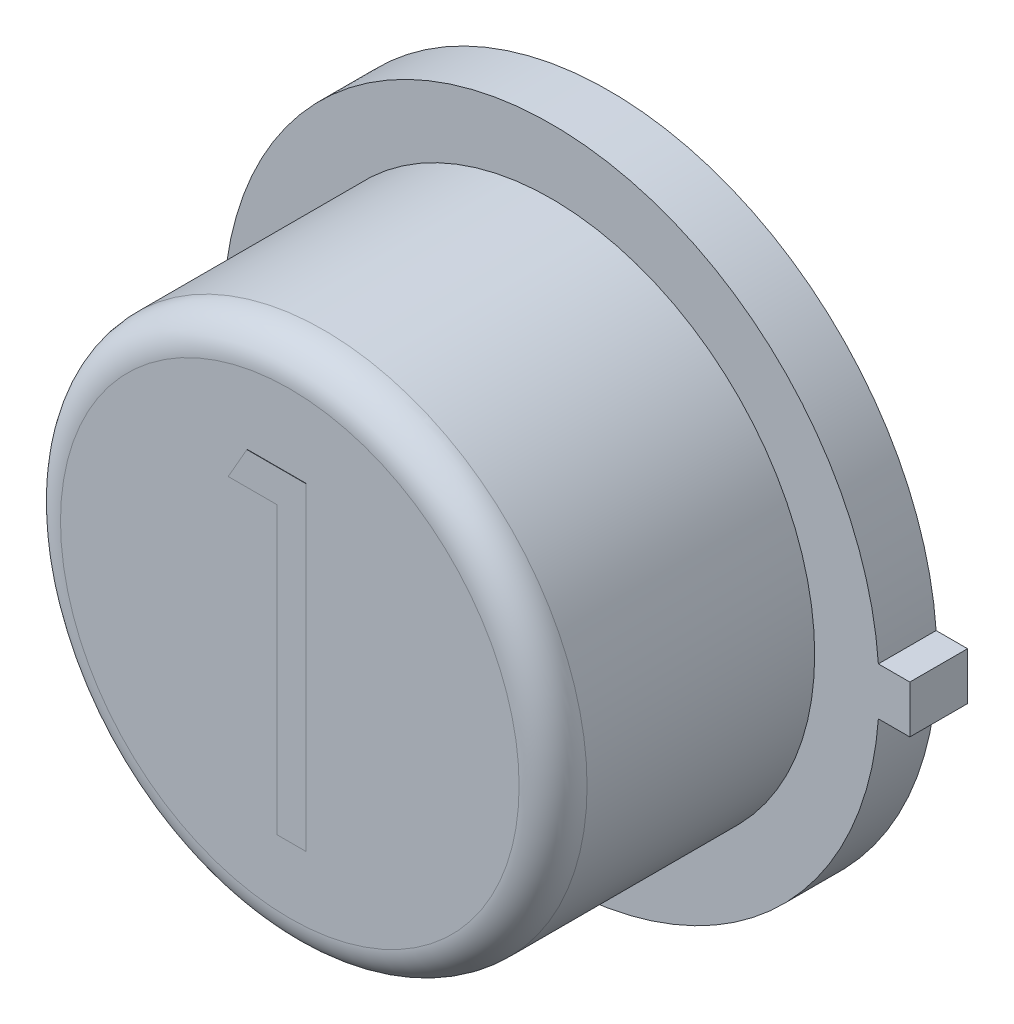
ISO-10303-21;
HEADER;
FILE_DESCRIPTION(('STEP AP214'),'2;1');
FILE_NAME('part.step','',(''),(''),'','','');
FILE_SCHEMA(('AUTOMOTIVE_DESIGN { 1 0 10303 214 1 1 1 1 }'));
ENDSEC;
DATA;
#1=APPLICATION_CONTEXT('core data for automotive mechanical design processes');
#2=APPLICATION_PROTOCOL_DEFINITION('international standard','automotive_design',2000,#1);
#3=PRODUCT_CONTEXT('',#1,'mechanical');
#4=PRODUCT('Part','Part','',(#3));
#5=PRODUCT_RELATED_PRODUCT_CATEGORY('part','',(#4));
#6=PRODUCT_DEFINITION_FORMATION('','',#4);
#7=PRODUCT_DEFINITION_CONTEXT('part definition',#1,'design');
#8=PRODUCT_DEFINITION('design','',#6,#7);
#9=PRODUCT_DEFINITION_SHAPE('','',#8);
#10=(LENGTH_UNIT() NAMED_UNIT(*) SI_UNIT(.MILLI.,.METRE.));
#11=(NAMED_UNIT(*) PLANE_ANGLE_UNIT() SI_UNIT($,.RADIAN.));
#12=(NAMED_UNIT(*) SI_UNIT($,.STERADIAN.) SOLID_ANGLE_UNIT());
#13=UNCERTAINTY_MEASURE_WITH_UNIT(LENGTH_MEASURE(1.E-05),#10,'distance_accuracy_value','');
#14=(GEOMETRIC_REPRESENTATION_CONTEXT(3) GLOBAL_UNCERTAINTY_ASSIGNED_CONTEXT((#13)) GLOBAL_UNIT_ASSIGNED_CONTEXT((#10,
#11,#12)) REPRESENTATION_CONTEXT('',''));
#15=CARTESIAN_POINT('',(0.,0.,0.));
#16=DIRECTION('',(0.,0.,1.));
#17=DIRECTION('',(1.,0.,0.));
#18=AXIS2_PLACEMENT_3D('',#15,#16,#17);
#19=CARTESIAN_POINT('',(-0.00322860507148085,-5.53029106093277,0.));
#20=DIRECTION('',(0.,0.,1.));
#21=DIRECTION('',(1.,0.,0.));
#22=AXIS2_PLACEMENT_3D('',#19,#20,#21);
#23=PLANE('',#22);
#24=DIRECTION('',(1.,0.,0.));
#25=VECTOR('',#24,1.);
#26=CARTESIAN_POINT('',(-0.0032286050714822,0.177799999999999,0.));
#27=LINE('',#26,#25);
#28=CARTESIAN_POINT('',(2.44464278985704,0.177799999999999,0.));
#29=VERTEX_POINT('',#28);
#30=CARTESIAN_POINT('',(2.6797,0.177799999999999,0.));
#31=VERTEX_POINT('',#30);
#32=EDGE_CURVE('E170',#29,#31,#27,.T.);
#33=ORIENTED_EDGE('',*,*,#32,.T.);
#34=DIRECTION('',(0.,-1.,0.));
#35=VECTOR('',#34,1.);
#36=CARTESIAN_POINT('',(2.6797,-5.53029106093277,0.));
#37=LINE('',#36,#35);
#38=CARTESIAN_POINT('',(2.6797,-0.1778,0.));
#39=VERTEX_POINT('',#38);
#40=EDGE_CURVE('E175',#31,#39,#37,.T.);
#41=ORIENTED_EDGE('',*,*,#40,.T.);
#42=DIRECTION('',(-1.,0.,0.));
#43=VECTOR('',#42,1.);
#44=CARTESIAN_POINT('',(-0.00322860507148085,-0.1778,0.));
#45=LINE('',#44,#43);
#46=CARTESIAN_POINT('',(2.44464278985704,-0.1778,0.));
#47=VERTEX_POINT('',#46);
#48=EDGE_CURVE('E189',#39,#47,#45,.T.);
#49=ORIENTED_EDGE('',*,*,#48,.T.);
#50=CARTESIAN_POINT('',(0.,0.,0.));
#51=DIRECTION('',(0.,0.,1.));
#52=DIRECTION('',(1.,0.,0.));
#53=AXIS2_PLACEMENT_3D('',#50,#51,#52);
#54=CIRCLE('',#53,2.4511);
#55=EDGE_CURVE('E186',#29,#47,#54,.T.);
#56=ORIENTED_EDGE('',*,*,#55,.F.);
#57=EDGE_LOOP('',(#33,#41,#49,#56));
#58=FACE_BOUND('',#57,.T.);
#59=CARTESIAN_POINT('',(0.,0.,0.));
#60=DIRECTION('',(0.,0.,1.));
#61=DIRECTION('',(1.,0.,0.));
#62=AXIS2_PLACEMENT_3D('',#59,#60,#61);
#63=CIRCLE('',#62,1.75756648099992);
#64=CARTESIAN_POINT('',(1.75756648099992,0.,0.));
#65=VERTEX_POINT('',#64);
#66=EDGE_CURVE('E201',#65,#65,#63,.F.);
#67=ORIENTED_EDGE('',*,*,#66,.F.);
#68=EDGE_LOOP('',(#67));
#69=FACE_BOUND('',#68,.T.);
#70=ADVANCED_FACE('F33',(#58,#69),#23,.F.);
#71=CARTESIAN_POINT('',(-0.00322860507148085,-5.53029106093277,0.4318));
#72=DIRECTION('',(0.,0.,1.));
#73=DIRECTION('',(1.,0.,0.));
#74=AXIS2_PLACEMENT_3D('',#71,#72,#73);
#75=PLANE('',#74);
#76=DIRECTION('',(1.,0.,0.));
#77=VECTOR('',#76,1.);
#78=CARTESIAN_POINT('',(-0.0032286050714822,0.177799999999999,0.4318));
#79=LINE('',#78,#77);
#80=CARTESIAN_POINT('',(2.44464278985704,0.177799999999999,0.4318));
#81=VERTEX_POINT('',#80);
#82=CARTESIAN_POINT('',(2.6797,0.177799999999999,0.4318));
#83=VERTEX_POINT('',#82);
#84=EDGE_CURVE('E171',#81,#83,#79,.T.);
#85=ORIENTED_EDGE('',*,*,#84,.F.);
#86=CARTESIAN_POINT('',(0.,0.,0.4318));
#87=DIRECTION('',(0.,0.,1.));
#88=DIRECTION('',(1.,0.,0.));
#89=AXIS2_PLACEMENT_3D('',#86,#87,#88);
#90=CIRCLE('',#89,2.4511);
#91=CARTESIAN_POINT('',(2.44464278985704,-0.1778,0.4318));
#92=VERTEX_POINT('',#91);
#93=EDGE_CURVE('E174',#81,#92,#90,.T.);
#94=ORIENTED_EDGE('',*,*,#93,.T.);
#95=DIRECTION('',(-1.,0.,0.));
#96=VECTOR('',#95,1.);
#97=CARTESIAN_POINT('',(-0.00322860507148085,-0.1778,0.4318));
#98=LINE('',#97,#96);
#99=CARTESIAN_POINT('',(2.6797,-0.1778,0.4318));
#100=VERTEX_POINT('',#99);
#101=EDGE_CURVE('E177',#100,#92,#98,.T.);
#102=ORIENTED_EDGE('',*,*,#101,.F.);
#103=DIRECTION('',(0.,-1.,0.));
#104=VECTOR('',#103,1.);
#105=CARTESIAN_POINT('',(2.6797,-5.53029106093277,0.4318));
#106=LINE('',#105,#104);
#107=EDGE_CURVE('E180',#83,#100,#106,.T.);
#108=ORIENTED_EDGE('',*,*,#107,.F.);
#109=EDGE_LOOP('',(#85,#94,#102,#108));
#110=FACE_BOUND('',#109,.T.);
#111=CARTESIAN_POINT('',(0.,0.,0.4318));
#112=DIRECTION('',(0.,0.,1.));
#113=DIRECTION('',(1.,0.,0.));
#114=AXIS2_PLACEMENT_3D('',#111,#112,#113);
#115=CIRCLE('',#114,1.9685);
#116=CARTESIAN_POINT('',(1.9685,0.,0.4318));
#117=VERTEX_POINT('',#116);
#118=EDGE_CURVE('E167',#117,#117,#115,.T.);
#119=ORIENTED_EDGE('',*,*,#118,.F.);
#120=EDGE_LOOP('',(#119));
#121=FACE_BOUND('',#120,.T.);
#122=ADVANCED_FACE('F222',(#110,#121),#75,.T.);
#123=CARTESIAN_POINT('',(-0.0032286050714822,0.177799999999999,0.4318));
#124=DIRECTION('',(0.,1.,0.));
#125=DIRECTION('',(-1.,0.,0.));
#126=AXIS2_PLACEMENT_3D('',#123,#124,#125);
#127=PLANE('',#126);
#128=ORIENTED_EDGE('',*,*,#32,.F.);
#129=DIRECTION('',(0.,0.,-1.));
#130=VECTOR('',#129,1.);
#131=CARTESIAN_POINT('',(2.44464278985704,0.177799999999999,0.4318));
#132=LINE('',#131,#130);
#133=EDGE_CURVE('E199',#81,#29,#132,.T.);
#134=ORIENTED_EDGE('',*,*,#133,.F.);
#135=ORIENTED_EDGE('',*,*,#84,.T.);
#136=DIRECTION('',(0.,0.,-1.));
#137=VECTOR('',#136,1.);
#138=CARTESIAN_POINT('',(2.6797,0.177799999999999,0.4318));
#139=LINE('',#138,#137);
#140=EDGE_CURVE('E183',#83,#31,#139,.T.);
#141=ORIENTED_EDGE('',*,*,#140,.T.);
#142=EDGE_LOOP('',(#128,#134,#135,#141));
#143=FACE_BOUND('',#142,.T.);
#144=ADVANCED_FACE('F228',(#143),#127,.T.);
#145=CARTESIAN_POINT('',(0.,0.,0.4318));
#146=DIRECTION('',(0.,0.,-1.));
#147=DIRECTION('',(-1.,0.,0.));
#148=AXIS2_PLACEMENT_3D('',#145,#146,#147);
#149=CYLINDRICAL_SURFACE('',#148,2.4511);
#150=ORIENTED_EDGE('',*,*,#55,.T.);
#151=DIRECTION('',(0.,0.,-1.));
#152=VECTOR('',#151,1.);
#153=CARTESIAN_POINT('',(2.44464278985704,-0.1778,0.4318));
#154=LINE('',#153,#152);
#155=EDGE_CURVE('E197',#92,#47,#154,.T.);
#156=ORIENTED_EDGE('',*,*,#155,.F.);
#157=ORIENTED_EDGE('',*,*,#93,.F.);
#158=ORIENTED_EDGE('',*,*,#133,.T.);
#159=EDGE_LOOP('',(#150,#156,#157,#158));
#160=FACE_BOUND('',#159,.T.);
#161=ADVANCED_FACE('F242',(#160),#149,.T.);
#162=CARTESIAN_POINT('',(-0.00322860507148085,-0.1778,0.4318));
#163=DIRECTION('',(0.,-1.,0.));
#164=DIRECTION('',(0.,0.,-1.));
#165=AXIS2_PLACEMENT_3D('',#162,#163,#164);
#166=PLANE('',#165);
#167=ORIENTED_EDGE('',*,*,#48,.F.);
#168=DIRECTION('',(0.,0.,-1.));
#169=VECTOR('',#168,1.);
#170=CARTESIAN_POINT('',(2.6797,-0.1778,0.4318));
#171=LINE('',#170,#169);
#172=EDGE_CURVE('E195',#100,#39,#171,.T.);
#173=ORIENTED_EDGE('',*,*,#172,.F.);
#174=ORIENTED_EDGE('',*,*,#101,.T.);
#175=ORIENTED_EDGE('',*,*,#155,.T.);
#176=EDGE_LOOP('',(#167,#173,#174,#175));
#177=FACE_BOUND('',#176,.T.);
#178=ADVANCED_FACE('F238',(#177),#166,.T.);
#179=CARTESIAN_POINT('',(2.6797,-5.53029106093277,0.4318));
#180=DIRECTION('',(1.,0.,0.));
#181=DIRECTION('',(0.,0.,-1.));
#182=AXIS2_PLACEMENT_3D('',#179,#180,#181);
#183=PLANE('',#182);
#184=ORIENTED_EDGE('',*,*,#40,.F.);
#185=ORIENTED_EDGE('',*,*,#140,.F.);
#186=ORIENTED_EDGE('',*,*,#107,.T.);
#187=ORIENTED_EDGE('',*,*,#172,.T.);
#188=EDGE_LOOP('',(#184,#185,#186,#187));
#189=FACE_BOUND('',#188,.T.);
#190=ADVANCED_FACE('F234',(#189),#183,.T.);
#191=CARTESIAN_POINT('',(0.,0.,2.3876));
#192=DIRECTION('',(0.,0.,-1.));
#193=DIRECTION('',(-1.,0.,0.));
#194=AXIS2_PLACEMENT_3D('',#191,#192,#193);
#195=CYLINDRICAL_SURFACE('',#194,1.9685);
#196=CARTESIAN_POINT('',(0.,0.,2.1336));
#197=DIRECTION('',(0.,0.,1.));
#198=DIRECTION('',(1.,0.,0.));
#199=AXIS2_PLACEMENT_3D('',#196,#197,#198);
#200=CIRCLE('',#199,1.9685);
#201=CARTESIAN_POINT('',(1.9685,0.,2.1336));
#202=VERTEX_POINT('',#201);
#203=EDGE_CURVE('E11',#202,#202,#200,.F.);
#204=ORIENTED_EDGE('',*,*,#203,.T.);
#205=EDGE_LOOP('',(#204));
#206=FACE_BOUND('',#205,.T.);
#207=ORIENTED_EDGE('',*,*,#118,.T.);
#208=EDGE_LOOP('',(#207));
#209=FACE_BOUND('',#208,.T.);
#210=ADVANCED_FACE('F237',(#206,#209),#195,.T.);
#211=CARTESIAN_POINT('',(0.,0.,2.3876));
#212=DIRECTION('',(0.,0.,1.));
#213=DIRECTION('',(1.,0.,0.));
#214=AXIS2_PLACEMENT_3D('',#211,#212,#213);
#215=PLANE('',#214);
#216=DIRECTION('',(0.496686511837685,0.867930013859708,0.));
#217=VECTOR('',#216,1.);
#218=CARTESIAN_POINT('',(-0.457932692307692,0.9188780238478,2.3876));
#219=LINE('',#218,#217);
#220=CARTESIAN_POINT('',(-0.457932692307692,0.9188780238478,2.3876));
#221=VERTEX_POINT('',#220);
#222=CARTESIAN_POINT('',(-0.318167818509615,1.16310879307857,2.3876));
#223=VERTEX_POINT('',#222);
#224=EDGE_CURVE('E146',#221,#223,#219,.T.);
#225=ORIENTED_EDGE('',*,*,#224,.T.);
#226=DIRECTION('',(1.,0.,0.));
#227=VECTOR('',#226,1.);
#228=CARTESIAN_POINT('',(-0.318167818509615,1.16310879307857,2.3876));
#229=LINE('',#228,#227);
#230=CARTESIAN_POINT('',(0.122115384615385,1.16310879307857,2.3876));
#231=VERTEX_POINT('',#230);
#232=EDGE_CURVE('E115',#223,#231,#229,.T.);
#233=ORIENTED_EDGE('',*,*,#232,.T.);
#234=DIRECTION('',(0.,-1.,0.));
#235=VECTOR('',#234,1.);
#236=CARTESIAN_POINT('',(0.122115384615385,1.16310879307857,2.3876));
#237=LINE('',#236,#235);
#238=CARTESIAN_POINT('',(0.122115384615385,-1.21814120692143,2.3876));
#239=VERTEX_POINT('',#238);
#240=EDGE_CURVE('E149',#231,#239,#237,.T.);
#241=ORIENTED_EDGE('',*,*,#240,.T.);
#242=DIRECTION('',(-1.,0.,0.));
#243=VECTOR('',#242,1.);
#244=CARTESIAN_POINT('',(0.122115384615385,-1.21814120692143,2.3876));
#245=LINE('',#244,#243);
#246=CARTESIAN_POINT('',(-0.0915865384615383,-1.21814120692143,2.3876));
#247=VERTEX_POINT('',#246);
#248=EDGE_CURVE('E151',#239,#247,#245,.T.);
#249=ORIENTED_EDGE('',*,*,#248,.T.);
#250=DIRECTION('',(0.,1.,0.));
#251=VECTOR('',#250,1.);
#252=CARTESIAN_POINT('',(-0.0915865384615383,-1.21814120692143,2.3876));
#253=LINE('',#252,#251);
#254=CARTESIAN_POINT('',(-0.0915865384615383,0.9188780238478,2.3876));
#255=VERTEX_POINT('',#254);
#256=EDGE_CURVE('E53',#247,#255,#253,.T.);
#257=ORIENTED_EDGE('',*,*,#256,.T.);
#258=DIRECTION('',(-1.,0.,0.));
#259=VECTOR('',#258,1.);
#260=CARTESIAN_POINT('',(-0.0915865384615383,0.9188780238478,2.3876));
#261=LINE('',#260,#259);
#262=EDGE_CURVE('E48',#255,#221,#261,.T.);
#263=ORIENTED_EDGE('',*,*,#262,.T.);
#264=EDGE_LOOP('',(#225,#233,#241,#249,#257,#263));
#265=FACE_BOUND('',#264,.T.);
#266=CARTESIAN_POINT('',(0.,0.,2.3876));
#267=DIRECTION('',(0.,0.,1.));
#268=DIRECTION('',(1.,0.,0.));
#269=AXIS2_PLACEMENT_3D('',#266,#267,#268);
#270=CIRCLE('',#269,1.7145);
#271=CARTESIAN_POINT('',(1.7145,0.,2.3876));
#272=VERTEX_POINT('',#271);
#273=EDGE_CURVE('E41',#272,#272,#270,.T.);
#274=ORIENTED_EDGE('',*,*,#273,.T.);
#275=EDGE_LOOP('',(#274));
#276=FACE_BOUND('',#275,.T.);
#277=ADVANCED_FACE('F206',(#265,#276),#215,.T.);
#278=CARTESIAN_POINT('',(0.,0.,-0.00254));
#279=DIRECTION('',(0.,0.,1.));
#280=DIRECTION('',(1.,0.,0.));
#281=AXIS2_PLACEMENT_3D('',#278,#279,#280);
#282=CYLINDRICAL_SURFACE('',#281,1.75756648099992);
#283=CARTESIAN_POINT('',(0.,0.,-0.00254));
#284=DIRECTION('',(0.,0.,-1.));
#285=DIRECTION('',(-1.,0.,0.));
#286=AXIS2_PLACEMENT_3D('',#283,#284,#285);
#287=CIRCLE('',#286,1.75756648099992);
#288=CARTESIAN_POINT('',(-1.75756648099992,0.,-0.00254));
#289=VERTEX_POINT('',#288);
#290=EDGE_CURVE('E155',#289,#289,#287,.T.);
#291=ORIENTED_EDGE('',*,*,#290,.F.);
#292=EDGE_LOOP('',(#291));
#293=FACE_BOUND('',#292,.T.);
#294=ORIENTED_EDGE('',*,*,#66,.T.);
#295=EDGE_LOOP('',(#294));
#296=FACE_BOUND('',#295,.T.);
#297=ADVANCED_FACE('F217',(#293,#296),#282,.T.);
#298=CARTESIAN_POINT('',(0.,0.,-0.00254));
#299=DIRECTION('',(0.,0.,-1.));
#300=DIRECTION('',(-1.,0.,0.));
#301=AXIS2_PLACEMENT_3D('',#298,#299,#300);
#302=PLANE('',#301);
#303=ORIENTED_EDGE('',*,*,#290,.T.);
#304=EDGE_LOOP('',(#303));
#305=FACE_BOUND('',#304,.T.);
#306=ADVANCED_FACE('F209',(#305),#302,.T.);
#307=CARTESIAN_POINT('',(0.,0.,2.1336));
#308=DIRECTION('',(0.,0.,1.));
#309=DIRECTION('',(1.,0.,0.));
#310=AXIS2_PLACEMENT_3D('',#307,#308,#309);
#311=TOROIDAL_SURFACE('',#310,1.7145,0.254);
#312=ORIENTED_EDGE('',*,*,#203,.F.);
#313=EDGE_LOOP('',(#312));
#314=FACE_BOUND('',#313,.T.);
#315=ORIENTED_EDGE('',*,*,#273,.F.);
#316=EDGE_LOOP('',(#315));
#317=FACE_BOUND('',#316,.T.);
#318=ADVANCED_FACE('F35',(#314,#317),#311,.T.);
#319=CARTESIAN_POINT('',(-0.457932692307692,0.9188780238478,2.39014));
#320=DIRECTION('',(-0.867930013859708,0.496686511837685,0.));
#321=DIRECTION('',(-0.496686511837685,-0.867930013859708,0.));
#322=AXIS2_PLACEMENT_3D('',#319,#320,#321);
#323=PLANE('',#322);
#324=ORIENTED_EDGE('',*,*,#224,.F.);
#325=DIRECTION('',(0.,0.,-1.));
#326=VECTOR('',#325,1.);
#327=CARTESIAN_POINT('',(-0.457932692307692,0.9188780238478,2.39014));
#328=LINE('',#327,#326);
#329=CARTESIAN_POINT('',(-0.457932692307692,0.9188780238478,2.39014));
#330=VERTEX_POINT('',#329);
#331=EDGE_CURVE('E134',#330,#221,#328,.T.);
#332=ORIENTED_EDGE('',*,*,#331,.F.);
#333=DIRECTION('',(0.496686511837685,0.867930013859708,0.));
#334=VECTOR('',#333,1.);
#335=CARTESIAN_POINT('',(-0.457932692307692,0.9188780238478,2.39014));
#336=LINE('',#335,#334);
#337=CARTESIAN_POINT('',(-0.318167818509615,1.16310879307857,2.39014));
#338=VERTEX_POINT('',#337);
#339=EDGE_CURVE('E127',#330,#338,#336,.T.);
#340=ORIENTED_EDGE('',*,*,#339,.T.);
#341=DIRECTION('',(0.,0.,-1.));
#342=VECTOR('',#341,1.);
#343=CARTESIAN_POINT('',(-0.318167818509615,1.16310879307857,2.39014));
#344=LINE('',#343,#342);
#345=EDGE_CURVE('E110',#338,#223,#344,.T.);
#346=ORIENTED_EDGE('',*,*,#345,.T.);
#347=EDGE_LOOP('',(#324,#332,#340,#346));
#348=FACE_BOUND('',#347,.T.);
#349=ADVANCED_FACE('F133',(#348),#323,.T.);
#350=CARTESIAN_POINT('',(-0.0915865384615383,0.9188780238478,2.39014));
#351=DIRECTION('',(0.,-1.,0.));
#352=DIRECTION('',(0.,0.,-1.));
#353=AXIS2_PLACEMENT_3D('',#350,#351,#352);
#354=PLANE('',#353);
#355=ORIENTED_EDGE('',*,*,#262,.F.);
#356=DIRECTION('',(0.,0.,-1.));
#357=VECTOR('',#356,1.);
#358=CARTESIAN_POINT('',(-0.0915865384615383,0.9188780238478,2.39014));
#359=LINE('',#358,#357);
#360=CARTESIAN_POINT('',(-0.0915865384615383,0.9188780238478,2.39014));
#361=VERTEX_POINT('',#360);
#362=EDGE_CURVE('E156',#361,#255,#359,.T.);
#363=ORIENTED_EDGE('',*,*,#362,.F.);
#364=DIRECTION('',(-1.,0.,0.));
#365=VECTOR('',#364,1.);
#366=CARTESIAN_POINT('',(-0.0915865384615383,0.9188780238478,2.39014));
#367=LINE('',#366,#365);
#368=EDGE_CURVE('E120',#361,#330,#367,.T.);
#369=ORIENTED_EDGE('',*,*,#368,.T.);
#370=ORIENTED_EDGE('',*,*,#331,.T.);
#371=EDGE_LOOP('',(#355,#363,#369,#370));
#372=FACE_BOUND('',#371,.T.);
#373=ADVANCED_FACE('F215',(#372),#354,.T.);
#374=CARTESIAN_POINT('',(-0.0915865384615383,-1.21814120692143,2.39014));
#375=DIRECTION('',(-1.,0.,0.));
#376=DIRECTION('',(0.,0.,1.));
#377=AXIS2_PLACEMENT_3D('',#374,#375,#376);
#378=PLANE('',#377);
#379=ORIENTED_EDGE('',*,*,#256,.F.);
#380=DIRECTION('',(0.,0.,-1.));
#381=VECTOR('',#380,1.);
#382=CARTESIAN_POINT('',(-0.0915865384615383,-1.21814120692143,2.39014));
#383=LINE('',#382,#381);
#384=CARTESIAN_POINT('',(-0.0915865384615383,-1.21814120692143,2.39014));
#385=VERTEX_POINT('',#384);
#386=EDGE_CURVE('E158',#385,#247,#383,.T.);
#387=ORIENTED_EDGE('',*,*,#386,.F.);
#388=DIRECTION('',(0.,1.,0.));
#389=VECTOR('',#388,1.);
#390=CARTESIAN_POINT('',(-0.0915865384615383,-1.21814120692143,2.39014));
#391=LINE('',#390,#389);
#392=EDGE_CURVE('E142',#385,#361,#391,.T.);
#393=ORIENTED_EDGE('',*,*,#392,.T.);
#394=ORIENTED_EDGE('',*,*,#362,.T.);
#395=EDGE_LOOP('',(#379,#387,#393,#394));
#396=FACE_BOUND('',#395,.T.);
#397=ADVANCED_FACE('F282',(#396),#378,.T.);
#398=CARTESIAN_POINT('',(0.122115384615385,-1.21814120692143,2.39014));
#399=DIRECTION('',(0.,-1.,0.));
#400=DIRECTION('',(0.,0.,-1.));
#401=AXIS2_PLACEMENT_3D('',#398,#399,#400);
#402=PLANE('',#401);
#403=ORIENTED_EDGE('',*,*,#248,.F.);
#404=DIRECTION('',(0.,0.,-1.));
#405=VECTOR('',#404,1.);
#406=CARTESIAN_POINT('',(0.122115384615385,-1.21814120692143,2.39014));
#407=LINE('',#406,#405);
#408=CARTESIAN_POINT('',(0.122115384615385,-1.21814120692143,2.39014));
#409=VERTEX_POINT('',#408);
#410=EDGE_CURVE('E161',#409,#239,#407,.T.);
#411=ORIENTED_EDGE('',*,*,#410,.F.);
#412=DIRECTION('',(-1.,0.,0.));
#413=VECTOR('',#412,1.);
#414=CARTESIAN_POINT('',(0.122115384615385,-1.21814120692143,2.39014));
#415=LINE('',#414,#413);
#416=EDGE_CURVE('E139',#409,#385,#415,.T.);
#417=ORIENTED_EDGE('',*,*,#416,.T.);
#418=ORIENTED_EDGE('',*,*,#386,.T.);
#419=EDGE_LOOP('',(#403,#411,#417,#418));
#420=FACE_BOUND('',#419,.T.);
#421=ADVANCED_FACE('F278',(#420),#402,.T.);
#422=CARTESIAN_POINT('',(0.122115384615385,1.16310879307857,2.39014));
#423=DIRECTION('',(1.,0.,0.));
#424=DIRECTION('',(0.,0.,-1.));
#425=AXIS2_PLACEMENT_3D('',#422,#423,#424);
#426=PLANE('',#425);
#427=ORIENTED_EDGE('',*,*,#240,.F.);
#428=DIRECTION('',(0.,0.,-1.));
#429=VECTOR('',#428,1.);
#430=CARTESIAN_POINT('',(0.122115384615385,1.16310879307857,2.39014));
#431=LINE('',#430,#429);
#432=CARTESIAN_POINT('',(0.122115384615385,1.16310879307857,2.39014));
#433=VERTEX_POINT('',#432);
#434=EDGE_CURVE('E119',#433,#231,#431,.T.);
#435=ORIENTED_EDGE('',*,*,#434,.F.);
#436=DIRECTION('',(0.,-1.,0.));
#437=VECTOR('',#436,1.);
#438=CARTESIAN_POINT('',(0.122115384615385,1.16310879307857,2.39014));
#439=LINE('',#438,#437);
#440=EDGE_CURVE('E131',#433,#409,#439,.T.);
#441=ORIENTED_EDGE('',*,*,#440,.T.);
#442=ORIENTED_EDGE('',*,*,#410,.T.);
#443=EDGE_LOOP('',(#427,#435,#441,#442));
#444=FACE_BOUND('',#443,.T.);
#445=ADVANCED_FACE('F275',(#444),#426,.T.);
#446=CARTESIAN_POINT('',(-0.318167818509615,1.16310879307857,2.39014));
#447=DIRECTION('',(0.,1.,0.));
#448=DIRECTION('',(0.,0.,1.));
#449=AXIS2_PLACEMENT_3D('',#446,#447,#448);
#450=PLANE('',#449);
#451=ORIENTED_EDGE('',*,*,#232,.F.);
#452=ORIENTED_EDGE('',*,*,#345,.F.);
#453=DIRECTION('',(1.,0.,0.));
#454=VECTOR('',#453,1.);
#455=CARTESIAN_POINT('',(-0.318167818509615,1.16310879307857,2.39014));
#456=LINE('',#455,#454);
#457=EDGE_CURVE('E114',#338,#433,#456,.T.);
#458=ORIENTED_EDGE('',*,*,#457,.T.);
#459=ORIENTED_EDGE('',*,*,#434,.T.);
#460=EDGE_LOOP('',(#451,#452,#458,#459));
#461=FACE_BOUND('',#460,.T.);
#462=ADVANCED_FACE('F112',(#461),#450,.T.);
#463=CARTESIAN_POINT('',(-0.318167818509615,1.16310879307857,2.39014));
#464=DIRECTION('',(0.,0.,-1.));
#465=DIRECTION('',(-1.,0.,0.));
#466=AXIS2_PLACEMENT_3D('',#463,#464,#465);
#467=PLANE('',#466);
#468=ORIENTED_EDGE('',*,*,#339,.F.);
#469=ORIENTED_EDGE('',*,*,#368,.F.);
#470=ORIENTED_EDGE('',*,*,#392,.F.);
#471=ORIENTED_EDGE('',*,*,#416,.F.);
#472=ORIENTED_EDGE('',*,*,#440,.F.);
#473=ORIENTED_EDGE('',*,*,#457,.F.);
#474=EDGE_LOOP('',(#468,#469,#470,#471,#472,#473));
#475=FACE_BOUND('',#474,.T.);
#476=ADVANCED_FACE('F125',(#475),#467,.F.);
#477=CLOSED_SHELL('',(#70,#122,#144,#161,#178,#190,#210,#277,#297,#306,#318,#349,#373,#397,#421,
#445,#462,#476));
#478=MANIFOLD_SOLID_BREP('B2',#477);
#479=ADVANCED_BREP_SHAPE_REPRESENTATION('',(#18,#478),#14);
#480=SHAPE_DEFINITION_REPRESENTATION(#9,#479);
ENDSEC;
END-ISO-10303-21;
